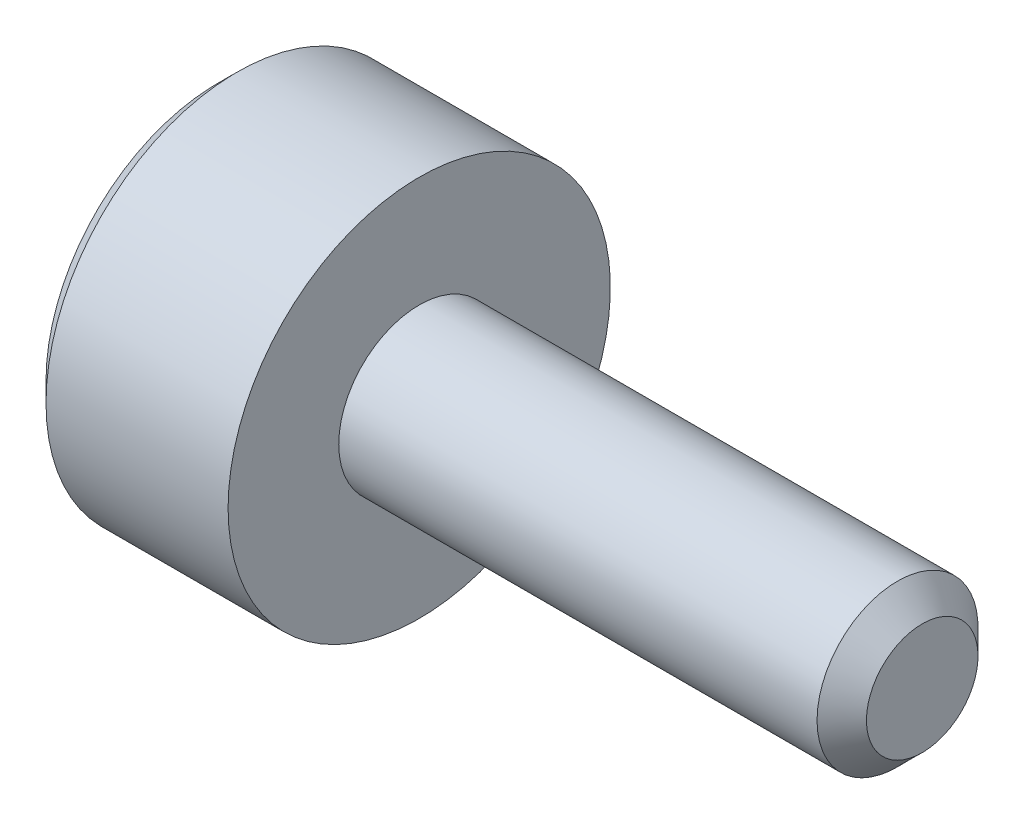
ISO-10303-21;
HEADER;
FILE_DESCRIPTION(('STEP AP214'),'2;1');
FILE_NAME('part.step','',(''),(''),'','','');
FILE_SCHEMA(('AUTOMOTIVE_DESIGN { 1 0 10303 214 1 1 1 1 }'));
ENDSEC;
DATA;
#1=APPLICATION_CONTEXT('core data for automotive mechanical design processes');
#2=APPLICATION_PROTOCOL_DEFINITION('international standard','automotive_design',2000,#1);
#3=PRODUCT_CONTEXT('',#1,'mechanical');
#4=PRODUCT('Part','Part','',(#3));
#5=PRODUCT_RELATED_PRODUCT_CATEGORY('part','',(#4));
#6=PRODUCT_DEFINITION_FORMATION('','',#4);
#7=PRODUCT_DEFINITION_CONTEXT('part definition',#1,'design');
#8=PRODUCT_DEFINITION('design','',#6,#7);
#9=PRODUCT_DEFINITION_SHAPE('','',#8);
#10=(LENGTH_UNIT() NAMED_UNIT(*) SI_UNIT(.MILLI.,.METRE.));
#11=(NAMED_UNIT(*) PLANE_ANGLE_UNIT() SI_UNIT($,.RADIAN.));
#12=(NAMED_UNIT(*) SI_UNIT($,.STERADIAN.) SOLID_ANGLE_UNIT());
#13=UNCERTAINTY_MEASURE_WITH_UNIT(LENGTH_MEASURE(1.E-05),#10,'distance_accuracy_value','');
#14=(GEOMETRIC_REPRESENTATION_CONTEXT(3) GLOBAL_UNCERTAINTY_ASSIGNED_CONTEXT((#13)) GLOBAL_UNIT_ASSIGNED_CONTEXT((#10,
#11,#12)) REPRESENTATION_CONTEXT('',''));
#15=CARTESIAN_POINT('',(0.,0.,0.));
#16=DIRECTION('',(0.,0.,1.));
#17=DIRECTION('',(1.,0.,0.));
#18=AXIS2_PLACEMENT_3D('',#15,#16,#17);
#19=CARTESIAN_POINT('',(-2.,0.,0.));
#20=DIRECTION('',(1.,0.,0.));
#21=DIRECTION('',(0.,0.,-1.));
#22=AXIS2_PLACEMENT_3D('',#19,#20,#21);
#23=PLANE('',#22);
#24=CARTESIAN_POINT('',(-2.,0.,0.));
#25=DIRECTION('',(-1.,0.,0.));
#26=DIRECTION('',(0.,0.,1.));
#27=AXIS2_PLACEMENT_3D('',#24,#25,#26);
#28=CIRCLE('',#27,1.71);
#29=CARTESIAN_POINT('',(-2.,0.,1.71));
#30=VERTEX_POINT('',#29);
#31=EDGE_CURVE('E11',#30,#30,#28,.T.);
#32=ORIENTED_EDGE('',*,*,#31,.T.);
#33=EDGE_LOOP('',(#32));
#34=FACE_BOUND('',#33,.T.);
#35=DIRECTION('',(0.,-1.,0.));
#36=VECTOR('',#35,1.);
#37=CARTESIAN_POINT('',(-2.,0.43301270189222,0.75));
#38=LINE('',#37,#36);
#39=CARTESIAN_POINT('',(-2.,0.43301270189222,0.75));
#40=VERTEX_POINT('',#39);
#41=CARTESIAN_POINT('',(-2.,-0.43301270189222,0.75));
#42=VERTEX_POINT('',#41);
#43=EDGE_CURVE('E51',#40,#42,#38,.T.);
#44=ORIENTED_EDGE('',*,*,#43,.T.);
#45=DIRECTION('',(0.,-0.500000000000001,-0.866025403784438));
#46=VECTOR('',#45,1.);
#47=CARTESIAN_POINT('',(-2.,-0.43301270189222,0.75));
#48=LINE('',#47,#46);
#49=CARTESIAN_POINT('',(-2.,-0.86602540378444,0.));
#50=VERTEX_POINT('',#49);
#51=EDGE_CURVE('E122',#42,#50,#48,.T.);
#52=ORIENTED_EDGE('',*,*,#51,.T.);
#53=DIRECTION('',(0.,0.500000000000001,-0.866025403784438));
#54=VECTOR('',#53,1.);
#55=CARTESIAN_POINT('',(-2.,-0.86602540378444,0.));
#56=LINE('',#55,#54);
#57=CARTESIAN_POINT('',(-2.,-0.43301270189222,-0.75));
#58=VERTEX_POINT('',#57);
#59=EDGE_CURVE('E125',#50,#58,#56,.T.);
#60=ORIENTED_EDGE('',*,*,#59,.T.);
#61=DIRECTION('',(0.,1.,0.));
#62=VECTOR('',#61,1.);
#63=CARTESIAN_POINT('',(-2.,-0.43301270189222,-0.75));
#64=LINE('',#63,#62);
#65=CARTESIAN_POINT('',(-2.,0.43301270189222,-0.75));
#66=VERTEX_POINT('',#65);
#67=EDGE_CURVE('E128',#58,#66,#64,.T.);
#68=ORIENTED_EDGE('',*,*,#67,.T.);
#69=DIRECTION('',(0.,0.500000000000001,0.866025403784438));
#70=VECTOR('',#69,1.);
#71=CARTESIAN_POINT('',(-2.,0.43301270189222,-0.75));
#72=LINE('',#71,#70);
#73=CARTESIAN_POINT('',(-2.,0.86602540378444,0.));
#74=VERTEX_POINT('',#73);
#75=EDGE_CURVE('E112',#66,#74,#72,.T.);
#76=ORIENTED_EDGE('',*,*,#75,.T.);
#77=DIRECTION('',(0.,-0.500000000000001,0.866025403784438));
#78=VECTOR('',#77,1.);
#79=CARTESIAN_POINT('',(-2.,0.86602540378444,0.));
#80=LINE('',#79,#78);
#81=EDGE_CURVE('E131',#74,#40,#80,.T.);
#82=ORIENTED_EDGE('',*,*,#81,.T.);
#83=EDGE_LOOP('',(#44,#52,#60,#68,#76,#82));
#84=FACE_BOUND('',#83,.T.);
#85=ADVANCED_FACE('F37',(#34,#84),#23,.F.);
#86=CARTESIAN_POINT('',(-1.81,0.,0.));
#87=DIRECTION('',(1.,0.,0.));
#88=DIRECTION('',(0.,0.,-1.));
#89=AXIS2_PLACEMENT_3D('',#86,#87,#88);
#90=CONICAL_SURFACE('',#89,1.9,0.785398163397448);
#91=ORIENTED_EDGE('',*,*,#31,.F.);
#92=EDGE_LOOP('',(#91));
#93=FACE_BOUND('',#92,.T.);
#94=CARTESIAN_POINT('',(-1.81,0.,0.));
#95=DIRECTION('',(-1.,0.,0.));
#96=DIRECTION('',(0.,0.,1.));
#97=AXIS2_PLACEMENT_3D('',#94,#95,#96);
#98=CIRCLE('',#97,1.9);
#99=CARTESIAN_POINT('',(-1.81,0.,1.9));
#100=VERTEX_POINT('',#99);
#101=EDGE_CURVE('E44',#100,#100,#98,.T.);
#102=ORIENTED_EDGE('',*,*,#101,.T.);
#103=EDGE_LOOP('',(#102));
#104=FACE_BOUND('',#103,.T.);
#105=ADVANCED_FACE('F156',(#93,#104),#90,.T.);
#106=CARTESIAN_POINT('',(5.,0.,0.));
#107=DIRECTION('',(-1.,0.,0.));
#108=DIRECTION('',(0.,0.,1.));
#109=AXIS2_PLACEMENT_3D('',#106,#107,#108);
#110=CYLINDRICAL_SURFACE('',#109,1.9);
#111=ORIENTED_EDGE('',*,*,#101,.F.);
#112=EDGE_LOOP('',(#111));
#113=FACE_BOUND('',#112,.T.);
#114=CARTESIAN_POINT('',(0.,0.,0.));
#115=DIRECTION('',(-1.,0.,0.));
#116=DIRECTION('',(0.,0.,1.));
#117=AXIS2_PLACEMENT_3D('',#114,#115,#116);
#118=CIRCLE('',#117,1.9);
#119=CARTESIAN_POINT('',(0.,0.,1.9));
#120=VERTEX_POINT('',#119);
#121=EDGE_CURVE('E151',#120,#120,#118,.T.);
#122=ORIENTED_EDGE('',*,*,#121,.T.);
#123=EDGE_LOOP('',(#122));
#124=FACE_BOUND('',#123,.T.);
#125=ADVANCED_FACE('F158',(#113,#124),#110,.T.);
#126=CARTESIAN_POINT('',(0.,1.9,0.));
#127=DIRECTION('',(-1.,0.,0.));
#128=DIRECTION('',(0.,0.,1.));
#129=AXIS2_PLACEMENT_3D('',#126,#127,#128);
#130=PLANE('',#129);
#131=ORIENTED_EDGE('',*,*,#121,.F.);
#132=EDGE_LOOP('',(#131));
#133=FACE_BOUND('',#132,.T.);
#134=CARTESIAN_POINT('',(0.,0.,0.));
#135=DIRECTION('',(-1.,0.,0.));
#136=DIRECTION('',(0.,0.,1.));
#137=AXIS2_PLACEMENT_3D('',#134,#135,#136);
#138=CIRCLE('',#137,0.8);
#139=CARTESIAN_POINT('',(0.,0.,0.8));
#140=VERTEX_POINT('',#139);
#141=EDGE_CURVE('E148',#140,#140,#138,.T.);
#142=ORIENTED_EDGE('',*,*,#141,.T.);
#143=EDGE_LOOP('',(#142));
#144=FACE_BOUND('',#143,.T.);
#145=ADVANCED_FACE('F161',(#133,#144),#130,.F.);
#146=CARTESIAN_POINT('',(5.,0.,0.));
#147=DIRECTION('',(-1.,0.,0.));
#148=DIRECTION('',(0.,0.,1.));
#149=AXIS2_PLACEMENT_3D('',#146,#147,#148);
#150=CYLINDRICAL_SURFACE('',#149,0.8);
#151=ORIENTED_EDGE('',*,*,#141,.F.);
#152=EDGE_LOOP('',(#151));
#153=FACE_BOUND('',#152,.T.);
#154=CARTESIAN_POINT('',(4.7545,0.,0.));
#155=DIRECTION('',(-1.,0.,0.));
#156=DIRECTION('',(0.,0.,1.));
#157=AXIS2_PLACEMENT_3D('',#154,#155,#156);
#158=CIRCLE('',#157,0.800000000000001);
#159=CARTESIAN_POINT('',(4.7545,0.,0.800000000000001));
#160=VERTEX_POINT('',#159);
#161=EDGE_CURVE('E145',#160,#160,#158,.T.);
#162=ORIENTED_EDGE('',*,*,#161,.T.);
#163=EDGE_LOOP('',(#162));
#164=FACE_BOUND('',#163,.T.);
#165=ADVANCED_FACE('F167',(#153,#164),#150,.T.);
#166=CARTESIAN_POINT('',(5.,0.,0.));
#167=DIRECTION('',(-1.,0.,0.));
#168=DIRECTION('',(0.,0.,1.));
#169=AXIS2_PLACEMENT_3D('',#166,#167,#168);
#170=CONICAL_SURFACE('',#169,0.554500000000001,0.785398163397447);
#171=ORIENTED_EDGE('',*,*,#161,.F.);
#172=EDGE_LOOP('',(#171));
#173=FACE_BOUND('',#172,.T.);
#174=CARTESIAN_POINT('',(5.,0.,0.));
#175=DIRECTION('',(-1.,0.,0.));
#176=DIRECTION('',(0.,0.,1.));
#177=AXIS2_PLACEMENT_3D('',#174,#175,#176);
#178=CIRCLE('',#177,0.554500000000001);
#179=CARTESIAN_POINT('',(5.,0.,0.554500000000001));
#180=VERTEX_POINT('',#179);
#181=EDGE_CURVE('E142',#180,#180,#178,.T.);
#182=ORIENTED_EDGE('',*,*,#181,.T.);
#183=EDGE_LOOP('',(#182));
#184=FACE_BOUND('',#183,.T.);
#185=ADVANCED_FACE('F173',(#173,#184),#170,.T.);
#186=CARTESIAN_POINT('',(5.,0.554500000000001,0.));
#187=DIRECTION('',(-1.,0.,0.));
#188=DIRECTION('',(0.,0.,1.));
#189=AXIS2_PLACEMENT_3D('',#186,#187,#188);
#190=PLANE('',#189);
#191=ORIENTED_EDGE('',*,*,#181,.F.);
#192=EDGE_LOOP('',(#191));
#193=FACE_BOUND('',#192,.T.);
#194=ADVANCED_FACE('F179',(#193),#190,.F.);
#195=CARTESIAN_POINT('',(-1.2,0.43301270189222,0.75));
#196=DIRECTION('',(0.,0.,-1.));
#197=DIRECTION('',(-1.,0.,0.));
#198=AXIS2_PLACEMENT_3D('',#195,#196,#197);
#199=PLANE('',#198);
#200=ORIENTED_EDGE('',*,*,#43,.F.);
#201=DIRECTION('',(-1.,0.,0.));
#202=VECTOR('',#201,1.);
#203=CARTESIAN_POINT('',(-1.2,0.43301270189222,0.75));
#204=LINE('',#203,#202);
#205=CARTESIAN_POINT('',(-1.2,0.43301270189222,0.75));
#206=VERTEX_POINT('',#205);
#207=EDGE_CURVE('E117',#206,#40,#204,.T.);
#208=ORIENTED_EDGE('',*,*,#207,.F.);
#209=DIRECTION('',(0.,-1.,0.));
#210=VECTOR('',#209,1.);
#211=CARTESIAN_POINT('',(-1.2,0.43301270189222,0.75));
#212=LINE('',#211,#210);
#213=CARTESIAN_POINT('',(-1.2,-0.43301270189222,0.75));
#214=VERTEX_POINT('',#213);
#215=EDGE_CURVE('E134',#206,#214,#212,.T.);
#216=ORIENTED_EDGE('',*,*,#215,.T.);
#217=DIRECTION('',(-1.,0.,0.));
#218=VECTOR('',#217,1.);
#219=CARTESIAN_POINT('',(-1.2,-0.43301270189222,0.75));
#220=LINE('',#219,#218);
#221=EDGE_CURVE('E140',#214,#42,#220,.T.);
#222=ORIENTED_EDGE('',*,*,#221,.T.);
#223=EDGE_LOOP('',(#200,#208,#216,#222));
#224=FACE_BOUND('',#223,.T.);
#225=ADVANCED_FACE('F184',(#224),#199,.T.);
#226=CARTESIAN_POINT('',(-1.2,-0.43301270189222,0.75));
#227=DIRECTION('',(0.,0.866025403784438,-0.500000000000001));
#228=DIRECTION('',(0.,0.500000000000001,0.866025403784438));
#229=AXIS2_PLACEMENT_3D('',#226,#227,#228);
#230=PLANE('',#229);
#231=ORIENTED_EDGE('',*,*,#51,.F.);
#232=ORIENTED_EDGE('',*,*,#221,.F.);
#233=DIRECTION('',(0.,-0.500000000000001,-0.866025403784438));
#234=VECTOR('',#233,1.);
#235=CARTESIAN_POINT('',(-1.2,-0.43301270189222,0.75));
#236=LINE('',#235,#234);
#237=CARTESIAN_POINT('',(-1.2,-0.86602540378444,0.));
#238=VERTEX_POINT('',#237);
#239=EDGE_CURVE('E90',#214,#238,#236,.T.);
#240=ORIENTED_EDGE('',*,*,#239,.T.);
#241=DIRECTION('',(-1.,0.,0.));
#242=VECTOR('',#241,1.);
#243=CARTESIAN_POINT('',(-1.2,-0.86602540378444,0.));
#244=LINE('',#243,#242);
#245=EDGE_CURVE('E138',#238,#50,#244,.T.);
#246=ORIENTED_EDGE('',*,*,#245,.T.);
#247=EDGE_LOOP('',(#231,#232,#240,#246));
#248=FACE_BOUND('',#247,.T.);
#249=ADVANCED_FACE('F189',(#248),#230,.T.);
#250=CARTESIAN_POINT('',(-1.2,-0.86602540378444,0.));
#251=DIRECTION('',(0.,0.866025403784438,0.500000000000001));
#252=DIRECTION('',(0.,-0.500000000000001,0.866025403784438));
#253=AXIS2_PLACEMENT_3D('',#250,#251,#252);
#254=PLANE('',#253);
#255=ORIENTED_EDGE('',*,*,#59,.F.);
#256=ORIENTED_EDGE('',*,*,#245,.F.);
#257=DIRECTION('',(0.,0.500000000000001,-0.866025403784438));
#258=VECTOR('',#257,1.);
#259=CARTESIAN_POINT('',(-1.2,-0.86602540378444,0.));
#260=LINE('',#259,#258);
#261=CARTESIAN_POINT('',(-1.2,-0.43301270189222,-0.75));
#262=VERTEX_POINT('',#261);
#263=EDGE_CURVE('E108',#238,#262,#260,.T.);
#264=ORIENTED_EDGE('',*,*,#263,.T.);
#265=DIRECTION('',(-1.,0.,0.));
#266=VECTOR('',#265,1.);
#267=CARTESIAN_POINT('',(-1.2,-0.43301270189222,-0.75));
#268=LINE('',#267,#266);
#269=EDGE_CURVE('E105',#262,#58,#268,.T.);
#270=ORIENTED_EDGE('',*,*,#269,.T.);
#271=EDGE_LOOP('',(#255,#256,#264,#270));
#272=FACE_BOUND('',#271,.T.);
#273=ADVANCED_FACE('F206',(#272),#254,.T.);
#274=CARTESIAN_POINT('',(-1.2,-0.43301270189222,-0.75));
#275=DIRECTION('',(0.,0.,1.));
#276=DIRECTION('',(1.,0.,0.));
#277=AXIS2_PLACEMENT_3D('',#274,#275,#276);
#278=PLANE('',#277);
#279=ORIENTED_EDGE('',*,*,#67,.F.);
#280=ORIENTED_EDGE('',*,*,#269,.F.);
#281=DIRECTION('',(0.,1.,0.));
#282=VECTOR('',#281,1.);
#283=CARTESIAN_POINT('',(-1.2,-0.43301270189222,-0.75));
#284=LINE('',#283,#282);
#285=CARTESIAN_POINT('',(-1.2,0.43301270189222,-0.75));
#286=VERTEX_POINT('',#285);
#287=EDGE_CURVE('E100',#262,#286,#284,.T.);
#288=ORIENTED_EDGE('',*,*,#287,.T.);
#289=DIRECTION('',(-1.,0.,0.));
#290=VECTOR('',#289,1.);
#291=CARTESIAN_POINT('',(-1.2,0.43301270189222,-0.75));
#292=LINE('',#291,#290);
#293=EDGE_CURVE('E104',#286,#66,#292,.T.);
#294=ORIENTED_EDGE('',*,*,#293,.T.);
#295=EDGE_LOOP('',(#279,#280,#288,#294));
#296=FACE_BOUND('',#295,.T.);
#297=ADVANCED_FACE('F103',(#296),#278,.T.);
#298=CARTESIAN_POINT('',(-1.2,0.43301270189222,-0.75));
#299=DIRECTION('',(0.,-0.866025403784438,0.500000000000001));
#300=DIRECTION('',(0.,-0.500000000000001,-0.866025403784438));
#301=AXIS2_PLACEMENT_3D('',#298,#299,#300);
#302=PLANE('',#301);
#303=ORIENTED_EDGE('',*,*,#75,.F.);
#304=ORIENTED_EDGE('',*,*,#293,.F.);
#305=DIRECTION('',(0.,0.500000000000001,0.866025403784438));
#306=VECTOR('',#305,1.);
#307=CARTESIAN_POINT('',(-1.2,0.43301270189222,-0.75));
#308=LINE('',#307,#306);
#309=CARTESIAN_POINT('',(-1.2,0.86602540378444,0.));
#310=VERTEX_POINT('',#309);
#311=EDGE_CURVE('E107',#286,#310,#308,.T.);
#312=ORIENTED_EDGE('',*,*,#311,.T.);
#313=DIRECTION('',(-1.,0.,0.));
#314=VECTOR('',#313,1.);
#315=CARTESIAN_POINT('',(-1.2,0.86602540378444,0.));
#316=LINE('',#315,#314);
#317=EDGE_CURVE('E81',#310,#74,#316,.T.);
#318=ORIENTED_EDGE('',*,*,#317,.T.);
#319=EDGE_LOOP('',(#303,#304,#312,#318));
#320=FACE_BOUND('',#319,.T.);
#321=ADVANCED_FACE('F110',(#320),#302,.T.);
#322=CARTESIAN_POINT('',(-1.2,0.86602540378444,0.));
#323=DIRECTION('',(0.,-0.866025403784438,-0.500000000000001));
#324=DIRECTION('',(0.,0.500000000000001,-0.866025403784438));
#325=AXIS2_PLACEMENT_3D('',#322,#323,#324);
#326=PLANE('',#325);
#327=ORIENTED_EDGE('',*,*,#81,.F.);
#328=ORIENTED_EDGE('',*,*,#317,.F.);
#329=DIRECTION('',(0.,-0.500000000000001,0.866025403784438));
#330=VECTOR('',#329,1.);
#331=CARTESIAN_POINT('',(-1.2,0.86602540378444,0.));
#332=LINE('',#331,#330);
#333=EDGE_CURVE('E59',#310,#206,#332,.T.);
#334=ORIENTED_EDGE('',*,*,#333,.T.);
#335=ORIENTED_EDGE('',*,*,#207,.T.);
#336=EDGE_LOOP('',(#327,#328,#334,#335));
#337=FACE_BOUND('',#336,.T.);
#338=ADVANCED_FACE('F199',(#337),#326,.T.);
#339=CARTESIAN_POINT('',(-1.2,0.,0.));
#340=DIRECTION('',(1.,0.,0.));
#341=DIRECTION('',(0.,0.,-1.));
#342=AXIS2_PLACEMENT_3D('',#339,#340,#341);
#343=PLANE('',#342);
#344=ORIENTED_EDGE('',*,*,#215,.F.);
#345=ORIENTED_EDGE('',*,*,#333,.F.);
#346=ORIENTED_EDGE('',*,*,#311,.F.);
#347=ORIENTED_EDGE('',*,*,#287,.F.);
#348=ORIENTED_EDGE('',*,*,#263,.F.);
#349=ORIENTED_EDGE('',*,*,#239,.F.);
#350=EDGE_LOOP('',(#344,#345,#346,#347,#348,#349));
#351=FACE_BOUND('',#350,.T.);
#352=ADVANCED_FACE('F115',(#351),#343,.F.);
#353=CLOSED_SHELL('',(#85,#105,#125,#145,#165,#185,#194,#225,#249,#273,#297,#321,#338,#352));
#354=MANIFOLD_SOLID_BREP('B2',#353);
#355=ADVANCED_BREP_SHAPE_REPRESENTATION('',(#18,#354),#14);
#356=SHAPE_DEFINITION_REPRESENTATION(#9,#355);
ENDSEC;
END-ISO-10303-21;
